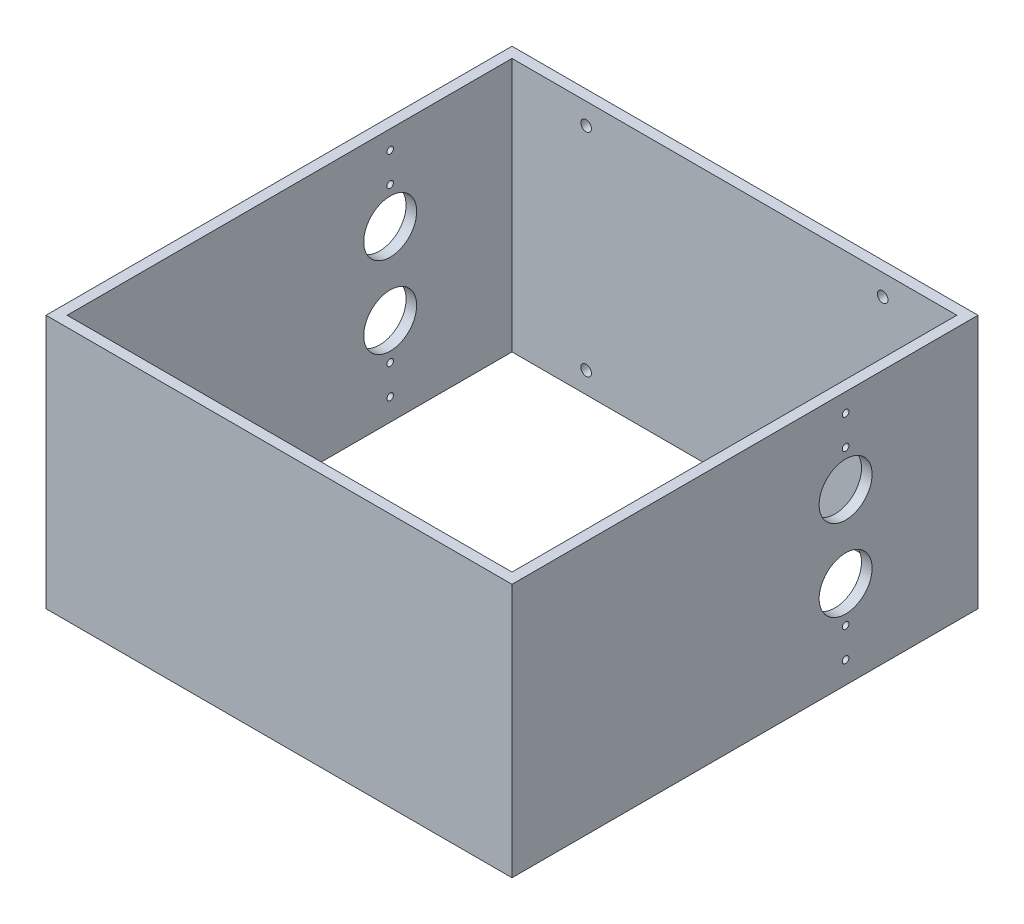
ISO-10303-21;
HEADER;
FILE_DESCRIPTION(('STEP AP214'),'2;1');
FILE_NAME('part.step','',(''),(''),'','','');
FILE_SCHEMA(('AUTOMOTIVE_DESIGN { 1 0 10303 214 1 1 1 1 }'));
ENDSEC;
DATA;
#1=APPLICATION_CONTEXT('core data for automotive mechanical design processes');
#2=APPLICATION_PROTOCOL_DEFINITION('international standard','automotive_design',2000,#1);
#3=PRODUCT_CONTEXT('',#1,'mechanical');
#4=PRODUCT('Part','Part','',(#3));
#5=PRODUCT_RELATED_PRODUCT_CATEGORY('part','',(#4));
#6=PRODUCT_DEFINITION_FORMATION('','',#4);
#7=PRODUCT_DEFINITION_CONTEXT('part definition',#1,'design');
#8=PRODUCT_DEFINITION('design','',#6,#7);
#9=PRODUCT_DEFINITION_SHAPE('','',#8);
#10=(LENGTH_UNIT() NAMED_UNIT(*) SI_UNIT(.MILLI.,.METRE.));
#11=(NAMED_UNIT(*) PLANE_ANGLE_UNIT() SI_UNIT($,.RADIAN.));
#12=(NAMED_UNIT(*) SI_UNIT($,.STERADIAN.) SOLID_ANGLE_UNIT());
#13=UNCERTAINTY_MEASURE_WITH_UNIT(LENGTH_MEASURE(1.E-05),#10,'distance_accuracy_value','');
#14=(GEOMETRIC_REPRESENTATION_CONTEXT(3) GLOBAL_UNCERTAINTY_ASSIGNED_CONTEXT((#13)) GLOBAL_UNIT_ASSIGNED_CONTEXT((#10,
#11,#12)) REPRESENTATION_CONTEXT('',''));
#15=CARTESIAN_POINT('',(0.,0.,0.));
#16=DIRECTION('',(0.,0.,1.));
#17=DIRECTION('',(1.,0.,0.));
#18=AXIS2_PLACEMENT_3D('',#15,#16,#17);
#19=CARTESIAN_POINT('',(-88.9,-12.7,-279.4));
#20=DIRECTION('',(0.,0.,-1.));
#21=DIRECTION('',(-1.,0.,0.));
#22=AXIS2_PLACEMENT_3D('',#19,#20,#21);
#23=CYLINDRICAL_SURFACE('',#22,3.175);
#24=CARTESIAN_POINT('',(-88.9,-12.7,-273.05));
#25=DIRECTION('',(0.,0.,-1.));
#26=DIRECTION('',(-1.,0.,0.));
#27=AXIS2_PLACEMENT_3D('',#24,#25,#26);
#28=CIRCLE('',#27,3.175);
#29=CARTESIAN_POINT('',(-92.075,-12.7,-273.05));
#30=VERTEX_POINT('',#29);
#31=EDGE_CURVE('E20',#30,#30,#28,.F.);
#32=ORIENTED_EDGE('',*,*,#31,.T.);
#33=EDGE_LOOP('',(#32));
#34=FACE_BOUND('',#33,.T.);
#35=CARTESIAN_POINT('',(-88.9,-12.7,-279.4));
#36=DIRECTION('',(0.,0.,-1.));
#37=DIRECTION('',(-1.,0.,0.));
#38=AXIS2_PLACEMENT_3D('',#35,#36,#37);
#39=CIRCLE('',#38,3.175);
#40=CARTESIAN_POINT('',(-92.075,-12.7,-279.4));
#41=VERTEX_POINT('',#40);
#42=EDGE_CURVE('E116',#41,#41,#39,.F.);
#43=ORIENTED_EDGE('',*,*,#42,.F.);
#44=EDGE_LOOP('',(#43));
#45=FACE_BOUND('',#44,.T.);
#46=ADVANCED_FACE('F17',(#34,#45),#23,.F.);
#47=CARTESIAN_POINT('',(88.9,-12.7,-279.4));
#48=DIRECTION('',(0.,0.,-1.));
#49=DIRECTION('',(-1.,0.,0.));
#50=AXIS2_PLACEMENT_3D('',#47,#48,#49);
#51=CYLINDRICAL_SURFACE('',#50,3.175);
#52=CARTESIAN_POINT('',(88.9,-12.7,-273.05));
#53=DIRECTION('',(0.,0.,-1.));
#54=DIRECTION('',(-1.,0.,0.));
#55=AXIS2_PLACEMENT_3D('',#52,#53,#54);
#56=CIRCLE('',#55,3.175);
#57=CARTESIAN_POINT('',(85.725,-12.7,-273.05));
#58=VERTEX_POINT('',#57);
#59=EDGE_CURVE('E209',#58,#58,#56,.F.);
#60=ORIENTED_EDGE('',*,*,#59,.T.);
#61=EDGE_LOOP('',(#60));
#62=FACE_BOUND('',#61,.T.);
#63=CARTESIAN_POINT('',(88.9,-12.7,-279.4));
#64=DIRECTION('',(0.,0.,-1.));
#65=DIRECTION('',(-1.,0.,0.));
#66=AXIS2_PLACEMENT_3D('',#63,#64,#65);
#67=CIRCLE('',#66,3.175);
#68=CARTESIAN_POINT('',(85.725,-12.7,-279.4));
#69=VERTEX_POINT('',#68);
#70=EDGE_CURVE('E184',#69,#69,#67,.F.);
#71=ORIENTED_EDGE('',*,*,#70,.F.);
#72=EDGE_LOOP('',(#71));
#73=FACE_BOUND('',#72,.T.);
#74=ADVANCED_FACE('F355',(#62,#73),#51,.F.);
#75=CARTESIAN_POINT('',(88.9,-139.7,-279.4));
#76=DIRECTION('',(0.,0.,-1.));
#77=DIRECTION('',(-1.,0.,0.));
#78=AXIS2_PLACEMENT_3D('',#75,#76,#77);
#79=CYLINDRICAL_SURFACE('',#78,3.175);
#80=CARTESIAN_POINT('',(88.9,-139.7,-273.05));
#81=DIRECTION('',(0.,0.,-1.));
#82=DIRECTION('',(-1.,0.,0.));
#83=AXIS2_PLACEMENT_3D('',#80,#81,#82);
#84=CIRCLE('',#83,3.175);
#85=CARTESIAN_POINT('',(85.725,-139.7,-273.05));
#86=VERTEX_POINT('',#85);
#87=EDGE_CURVE('E207',#86,#86,#84,.F.);
#88=ORIENTED_EDGE('',*,*,#87,.T.);
#89=EDGE_LOOP('',(#88));
#90=FACE_BOUND('',#89,.T.);
#91=CARTESIAN_POINT('',(88.9,-139.7,-279.4));
#92=DIRECTION('',(0.,0.,-1.));
#93=DIRECTION('',(-1.,0.,0.));
#94=AXIS2_PLACEMENT_3D('',#91,#92,#93);
#95=CIRCLE('',#94,3.175);
#96=CARTESIAN_POINT('',(85.725,-139.7,-279.4));
#97=VERTEX_POINT('',#96);
#98=EDGE_CURVE('E181',#97,#97,#95,.F.);
#99=ORIENTED_EDGE('',*,*,#98,.F.);
#100=EDGE_LOOP('',(#99));
#101=FACE_BOUND('',#100,.T.);
#102=ADVANCED_FACE('F352',(#90,#101),#79,.F.);
#103=CARTESIAN_POINT('',(-88.9,-139.7,-279.4));
#104=DIRECTION('',(0.,0.,-1.));
#105=DIRECTION('',(-1.,0.,0.));
#106=AXIS2_PLACEMENT_3D('',#103,#104,#105);
#107=CYLINDRICAL_SURFACE('',#106,3.175);
#108=CARTESIAN_POINT('',(-88.9,-139.7,-273.05));
#109=DIRECTION('',(0.,0.,-1.));
#110=DIRECTION('',(-1.,0.,0.));
#111=AXIS2_PLACEMENT_3D('',#108,#109,#110);
#112=CIRCLE('',#111,3.175);
#113=CARTESIAN_POINT('',(-92.075,-139.7,-273.05));
#114=VERTEX_POINT('',#113);
#115=EDGE_CURVE('E121',#114,#114,#112,.F.);
#116=ORIENTED_EDGE('',*,*,#115,.T.);
#117=EDGE_LOOP('',(#116));
#118=FACE_BOUND('',#117,.T.);
#119=CARTESIAN_POINT('',(-88.9,-139.7,-279.4));
#120=DIRECTION('',(0.,0.,-1.));
#121=DIRECTION('',(-1.,0.,0.));
#122=AXIS2_PLACEMENT_3D('',#119,#120,#121);
#123=CIRCLE('',#122,3.175);
#124=CARTESIAN_POINT('',(-92.075,-139.7,-279.4));
#125=VERTEX_POINT('',#124);
#126=EDGE_CURVE('E178',#125,#125,#123,.F.);
#127=ORIENTED_EDGE('',*,*,#126,.F.);
#128=EDGE_LOOP('',(#127));
#129=FACE_BOUND('',#128,.T.);
#130=ADVANCED_FACE('F348',(#118,#129),#107,.F.);
#131=CARTESIAN_POINT('',(-139.7,-50.8,-200.025));
#132=DIRECTION('',(1.,0.,0.));
#133=DIRECTION('',(0.,0.,-1.));
#134=AXIS2_PLACEMENT_3D('',#131,#132,#133);
#135=CYLINDRICAL_SURFACE('',#134,15.875);
#136=CARTESIAN_POINT('',(133.35,-50.8,-200.025));
#137=DIRECTION('',(1.,0.,0.));
#138=DIRECTION('',(0.,0.,-1.));
#139=AXIS2_PLACEMENT_3D('',#136,#137,#138);
#140=CIRCLE('',#139,15.875);
#141=CARTESIAN_POINT('',(133.35,-50.8,-215.9));
#142=VERTEX_POINT('',#141);
#143=EDGE_CURVE('E120',#142,#142,#140,.F.);
#144=ORIENTED_EDGE('',*,*,#143,.T.);
#145=EDGE_LOOP('',(#144));
#146=FACE_BOUND('',#145,.T.);
#147=CARTESIAN_POINT('',(139.7,-50.8,-200.025));
#148=DIRECTION('',(1.,0.,0.));
#149=DIRECTION('',(0.,0.,-1.));
#150=AXIS2_PLACEMENT_3D('',#147,#148,#149);
#151=CIRCLE('',#150,15.875);
#152=CARTESIAN_POINT('',(139.7,-50.8,-215.9));
#153=VERTEX_POINT('',#152);
#154=EDGE_CURVE('E157',#153,#153,#151,.F.);
#155=ORIENTED_EDGE('',*,*,#154,.F.);
#156=EDGE_LOOP('',(#155));
#157=FACE_BOUND('',#156,.T.);
#158=ADVANCED_FACE('F344',(#146,#157),#135,.F.);
#159=CARTESIAN_POINT('',(-139.7,-99.568,-200.025));
#160=DIRECTION('',(1.,0.,0.));
#161=DIRECTION('',(0.,0.,-1.));
#162=AXIS2_PLACEMENT_3D('',#159,#160,#161);
#163=CYLINDRICAL_SURFACE('',#162,15.875);
#164=CARTESIAN_POINT('',(133.35,-99.568,-200.025));
#165=DIRECTION('',(1.,0.,0.));
#166=DIRECTION('',(0.,0.,-1.));
#167=AXIS2_PLACEMENT_3D('',#164,#165,#166);
#168=CIRCLE('',#167,15.875);
#169=CARTESIAN_POINT('',(133.35,-99.568,-215.9));
#170=VERTEX_POINT('',#169);
#171=EDGE_CURVE('E200',#170,#170,#168,.F.);
#172=ORIENTED_EDGE('',*,*,#171,.T.);
#173=EDGE_LOOP('',(#172));
#174=FACE_BOUND('',#173,.T.);
#175=CARTESIAN_POINT('',(139.7,-99.568,-200.025));
#176=DIRECTION('',(1.,0.,0.));
#177=DIRECTION('',(0.,0.,-1.));
#178=AXIS2_PLACEMENT_3D('',#175,#176,#177);
#179=CIRCLE('',#178,15.875);
#180=CARTESIAN_POINT('',(139.7,-99.568,-215.9));
#181=VERTEX_POINT('',#180);
#182=EDGE_CURVE('E154',#181,#181,#179,.F.);
#183=ORIENTED_EDGE('',*,*,#182,.F.);
#184=EDGE_LOOP('',(#183));
#185=FACE_BOUND('',#184,.T.);
#186=ADVANCED_FACE('F340',(#174,#185),#163,.F.);
#187=CARTESIAN_POINT('',(-139.7,-139.192,-200.025));
#188=DIRECTION('',(-1.,0.,0.));
#189=DIRECTION('',(0.,0.,1.));
#190=AXIS2_PLACEMENT_3D('',#187,#188,#189);
#191=CYLINDRICAL_SURFACE('',#190,1.9812);
#192=CARTESIAN_POINT('',(133.35,-139.192,-200.025));
#193=DIRECTION('',(-1.,0.,0.));
#194=DIRECTION('',(0.,0.,1.));
#195=AXIS2_PLACEMENT_3D('',#192,#193,#194);
#196=CIRCLE('',#195,1.9812);
#197=CARTESIAN_POINT('',(133.35,-139.192,-198.0438));
#198=VERTEX_POINT('',#197);
#199=EDGE_CURVE('E197',#198,#198,#196,.T.);
#200=ORIENTED_EDGE('',*,*,#199,.T.);
#201=EDGE_LOOP('',(#200));
#202=FACE_BOUND('',#201,.T.);
#203=CARTESIAN_POINT('',(139.7,-139.192,-200.025));
#204=DIRECTION('',(-1.,0.,0.));
#205=DIRECTION('',(0.,0.,1.));
#206=AXIS2_PLACEMENT_3D('',#203,#204,#205);
#207=CIRCLE('',#206,1.9812);
#208=CARTESIAN_POINT('',(139.7,-139.192,-198.0438));
#209=VERTEX_POINT('',#208);
#210=EDGE_CURVE('E151',#209,#209,#207,.T.);
#211=ORIENTED_EDGE('',*,*,#210,.F.);
#212=EDGE_LOOP('',(#211));
#213=FACE_BOUND('',#212,.T.);
#214=ADVANCED_FACE('F336',(#202,#213),#191,.F.);
#215=CARTESIAN_POINT('',(-139.7,-121.412,-200.025));
#216=DIRECTION('',(-1.,0.,0.));
#217=DIRECTION('',(0.,0.,1.));
#218=AXIS2_PLACEMENT_3D('',#215,#216,#217);
#219=CYLINDRICAL_SURFACE('',#218,1.9812);
#220=CARTESIAN_POINT('',(133.35,-121.412,-200.025));
#221=DIRECTION('',(-1.,0.,0.));
#222=DIRECTION('',(0.,0.,1.));
#223=AXIS2_PLACEMENT_3D('',#220,#221,#222);
#224=CIRCLE('',#223,1.9812);
#225=CARTESIAN_POINT('',(133.35,-121.412,-198.0438));
#226=VERTEX_POINT('',#225);
#227=EDGE_CURVE('E194',#226,#226,#224,.T.);
#228=ORIENTED_EDGE('',*,*,#227,.T.);
#229=EDGE_LOOP('',(#228));
#230=FACE_BOUND('',#229,.T.);
#231=CARTESIAN_POINT('',(139.7,-121.412,-200.025));
#232=DIRECTION('',(-1.,0.,0.));
#233=DIRECTION('',(0.,0.,1.));
#234=AXIS2_PLACEMENT_3D('',#231,#232,#233);
#235=CIRCLE('',#234,1.9812);
#236=CARTESIAN_POINT('',(139.7,-121.412,-198.0438));
#237=VERTEX_POINT('',#236);
#238=EDGE_CURVE('E148',#237,#237,#235,.T.);
#239=ORIENTED_EDGE('',*,*,#238,.F.);
#240=EDGE_LOOP('',(#239));
#241=FACE_BOUND('',#240,.T.);
#242=ADVANCED_FACE('F332',(#230,#241),#219,.F.);
#243=CARTESIAN_POINT('',(-139.7,-28.956,-200.025));
#244=DIRECTION('',(-1.,0.,0.));
#245=DIRECTION('',(0.,0.,1.));
#246=AXIS2_PLACEMENT_3D('',#243,#244,#245);
#247=CYLINDRICAL_SURFACE('',#246,1.9812);
#248=CARTESIAN_POINT('',(133.35,-28.956,-200.025));
#249=DIRECTION('',(-1.,0.,0.));
#250=DIRECTION('',(0.,0.,1.));
#251=AXIS2_PLACEMENT_3D('',#248,#249,#250);
#252=CIRCLE('',#251,1.9812);
#253=CARTESIAN_POINT('',(133.35,-28.956,-198.0438));
#254=VERTEX_POINT('',#253);
#255=EDGE_CURVE('E191',#254,#254,#252,.T.);
#256=ORIENTED_EDGE('',*,*,#255,.T.);
#257=EDGE_LOOP('',(#256));
#258=FACE_BOUND('',#257,.T.);
#259=CARTESIAN_POINT('',(139.7,-28.956,-200.025));
#260=DIRECTION('',(-1.,0.,0.));
#261=DIRECTION('',(0.,0.,1.));
#262=AXIS2_PLACEMENT_3D('',#259,#260,#261);
#263=CIRCLE('',#262,1.9812);
#264=CARTESIAN_POINT('',(139.7,-28.956,-198.0438));
#265=VERTEX_POINT('',#264);
#266=EDGE_CURVE('E145',#265,#265,#263,.T.);
#267=ORIENTED_EDGE('',*,*,#266,.F.);
#268=EDGE_LOOP('',(#267));
#269=FACE_BOUND('',#268,.T.);
#270=ADVANCED_FACE('F328',(#258,#269),#247,.F.);
#271=CARTESIAN_POINT('',(-139.7,-11.176,-200.025));
#272=DIRECTION('',(-1.,0.,0.));
#273=DIRECTION('',(0.,0.,1.));
#274=AXIS2_PLACEMENT_3D('',#271,#272,#273);
#275=CYLINDRICAL_SURFACE('',#274,1.9812);
#276=CARTESIAN_POINT('',(133.35,-11.176,-200.025));
#277=DIRECTION('',(-1.,0.,0.));
#278=DIRECTION('',(0.,0.,1.));
#279=AXIS2_PLACEMENT_3D('',#276,#277,#278);
#280=CIRCLE('',#279,1.9812);
#281=CARTESIAN_POINT('',(133.35,-11.176,-198.0438));
#282=VERTEX_POINT('',#281);
#283=EDGE_CURVE('E92',#282,#282,#280,.T.);
#284=ORIENTED_EDGE('',*,*,#283,.T.);
#285=EDGE_LOOP('',(#284));
#286=FACE_BOUND('',#285,.T.);
#287=CARTESIAN_POINT('',(139.7,-11.176,-200.025));
#288=DIRECTION('',(-1.,0.,0.));
#289=DIRECTION('',(0.,0.,1.));
#290=AXIS2_PLACEMENT_3D('',#287,#288,#289);
#291=CIRCLE('',#290,1.9812);
#292=CARTESIAN_POINT('',(139.7,-11.176,-198.0438));
#293=VERTEX_POINT('',#292);
#294=EDGE_CURVE('E141',#293,#293,#291,.T.);
#295=ORIENTED_EDGE('',*,*,#294,.F.);
#296=EDGE_LOOP('',(#295));
#297=FACE_BOUND('',#296,.T.);
#298=ADVANCED_FACE('F221',(#286,#297),#275,.F.);
#299=CARTESIAN_POINT('',(-133.35,-152.4,-273.05));
#300=DIRECTION('',(0.,0.,-1.));
#301=DIRECTION('',(-1.,0.,0.));
#302=AXIS2_PLACEMENT_3D('',#299,#300,#301);
#303=PLANE('',#302);
#304=ORIENTED_EDGE('',*,*,#115,.F.);
#305=EDGE_LOOP('',(#304));
#306=FACE_BOUND('',#305,.T.);
#307=ORIENTED_EDGE('',*,*,#87,.F.);
#308=EDGE_LOOP('',(#307));
#309=FACE_BOUND('',#308,.T.);
#310=ORIENTED_EDGE('',*,*,#59,.F.);
#311=EDGE_LOOP('',(#310));
#312=FACE_BOUND('',#311,.T.);
#313=ORIENTED_EDGE('',*,*,#31,.F.);
#314=EDGE_LOOP('',(#313));
#315=FACE_BOUND('',#314,.T.);
#316=DIRECTION('',(1.,0.,0.));
#317=VECTOR('',#316,1.);
#318=CARTESIAN_POINT('',(-139.7,0.,-273.05));
#319=LINE('',#318,#317);
#320=CARTESIAN_POINT('',(-133.35,0.,-273.05));
#321=VERTEX_POINT('',#320);
#322=CARTESIAN_POINT('',(133.35,0.,-273.05));
#323=VERTEX_POINT('',#322);
#324=EDGE_CURVE('E225',#321,#323,#319,.T.);
#325=ORIENTED_EDGE('',*,*,#324,.F.);
#326=DIRECTION('',(0.,1.,0.));
#327=VECTOR('',#326,1.);
#328=CARTESIAN_POINT('',(-133.35,0.,-273.05));
#329=LINE('',#328,#327);
#330=CARTESIAN_POINT('',(-133.35,-152.4,-273.05));
#331=VERTEX_POINT('',#330);
#332=EDGE_CURVE('E91',#331,#321,#329,.T.);
#333=ORIENTED_EDGE('',*,*,#332,.F.);
#334=DIRECTION('',(1.,0.,0.));
#335=VECTOR('',#334,1.);
#336=CARTESIAN_POINT('',(-139.7,-152.4,-273.05));
#337=LINE('',#336,#335);
#338=CARTESIAN_POINT('',(133.35,-152.4,-273.05));
#339=VERTEX_POINT('',#338);
#340=EDGE_CURVE('E101',#339,#331,#337,.F.);
#341=ORIENTED_EDGE('',*,*,#340,.F.);
#342=DIRECTION('',(0.,1.,0.));
#343=VECTOR('',#342,1.);
#344=CARTESIAN_POINT('',(133.35,0.,-273.05));
#345=LINE('',#344,#343);
#346=EDGE_CURVE('E97',#339,#323,#345,.T.);
#347=ORIENTED_EDGE('',*,*,#346,.T.);
#348=EDGE_LOOP('',(#325,#333,#341,#347));
#349=FACE_BOUND('',#348,.T.);
#350=ADVANCED_FACE('F218',(#306,#309,#312,#315,#349),#303,.F.);
#351=CARTESIAN_POINT('',(133.35,0.,0.));
#352=DIRECTION('',(1.,0.,0.));
#353=DIRECTION('',(0.,0.,-1.));
#354=AXIS2_PLACEMENT_3D('',#351,#352,#353);
#355=PLANE('',#354);
#356=ORIENTED_EDGE('',*,*,#283,.F.);
#357=EDGE_LOOP('',(#356));
#358=FACE_BOUND('',#357,.T.);
#359=ORIENTED_EDGE('',*,*,#255,.F.);
#360=EDGE_LOOP('',(#359));
#361=FACE_BOUND('',#360,.T.);
#362=ORIENTED_EDGE('',*,*,#227,.F.);
#363=EDGE_LOOP('',(#362));
#364=FACE_BOUND('',#363,.T.);
#365=ORIENTED_EDGE('',*,*,#199,.F.);
#366=EDGE_LOOP('',(#365));
#367=FACE_BOUND('',#366,.T.);
#368=ORIENTED_EDGE('',*,*,#171,.F.);
#369=EDGE_LOOP('',(#368));
#370=FACE_BOUND('',#369,.T.);
#371=ORIENTED_EDGE('',*,*,#143,.F.);
#372=EDGE_LOOP('',(#371));
#373=FACE_BOUND('',#372,.T.);
#374=DIRECTION('',(0.,0.,1.));
#375=VECTOR('',#374,1.);
#376=CARTESIAN_POINT('',(133.35,0.,-279.4));
#377=LINE('',#376,#375);
#378=CARTESIAN_POINT('',(133.35,0.,-6.35));
#379=VERTEX_POINT('',#378);
#380=EDGE_CURVE('E228',#323,#379,#377,.T.);
#381=ORIENTED_EDGE('',*,*,#380,.F.);
#382=ORIENTED_EDGE('',*,*,#346,.F.);
#383=DIRECTION('',(0.,0.,-1.));
#384=VECTOR('',#383,1.);
#385=CARTESIAN_POINT('',(133.35,-152.4,0.));
#386=LINE('',#385,#384);
#387=CARTESIAN_POINT('',(133.35,-152.4,-6.35));
#388=VERTEX_POINT('',#387);
#389=EDGE_CURVE('E95',#388,#339,#386,.T.);
#390=ORIENTED_EDGE('',*,*,#389,.F.);
#391=DIRECTION('',(0.,1.,0.));
#392=VECTOR('',#391,1.);
#393=CARTESIAN_POINT('',(133.35,0.,-6.35));
#394=LINE('',#393,#392);
#395=EDGE_CURVE('E83',#388,#379,#394,.T.);
#396=ORIENTED_EDGE('',*,*,#395,.T.);
#397=EDGE_LOOP('',(#381,#382,#390,#396));
#398=FACE_BOUND('',#397,.T.);
#399=ADVANCED_FACE('F96',(#358,#361,#364,#367,#370,#373,#398),#355,.F.);
#400=CARTESIAN_POINT('',(-133.35,0.,-6.35));
#401=DIRECTION('',(0.,0.,1.));
#402=DIRECTION('',(1.,0.,0.));
#403=AXIS2_PLACEMENT_3D('',#400,#401,#402);
#404=PLANE('',#403);
#405=DIRECTION('',(1.,0.,0.));
#406=VECTOR('',#405,1.);
#407=CARTESIAN_POINT('',(-139.7,0.,-6.35000000000002));
#408=LINE('',#407,#406);
#409=CARTESIAN_POINT('',(-133.35,0.,-6.35));
#410=VERTEX_POINT('',#409);
#411=EDGE_CURVE('E87',#379,#410,#408,.F.);
#412=ORIENTED_EDGE('',*,*,#411,.F.);
#413=ORIENTED_EDGE('',*,*,#395,.F.);
#414=DIRECTION('',(1.,0.,0.));
#415=VECTOR('',#414,1.);
#416=CARTESIAN_POINT('',(-139.7,-152.4,-6.35));
#417=LINE('',#416,#415);
#418=CARTESIAN_POINT('',(-133.35,-152.4,-6.35));
#419=VERTEX_POINT('',#418);
#420=EDGE_CURVE('E80',#419,#388,#417,.T.);
#421=ORIENTED_EDGE('',*,*,#420,.F.);
#422=DIRECTION('',(0.,1.,0.));
#423=VECTOR('',#422,1.);
#424=CARTESIAN_POINT('',(-133.35,0.,-6.35));
#425=LINE('',#424,#423);
#426=EDGE_CURVE('E114',#410,#419,#425,.F.);
#427=ORIENTED_EDGE('',*,*,#426,.F.);
#428=EDGE_LOOP('',(#412,#413,#421,#427));
#429=FACE_BOUND('',#428,.T.);
#430=ADVANCED_FACE('F85',(#429),#404,.F.);
#431=CARTESIAN_POINT('',(-133.35,0.,0.));
#432=DIRECTION('',(1.,0.,0.));
#433=DIRECTION('',(0.,0.,-1.));
#434=AXIS2_PLACEMENT_3D('',#431,#432,#433);
#435=PLANE('',#434);
#436=CARTESIAN_POINT('',(-133.35,-11.176,-200.025));
#437=DIRECTION('',(-1.,0.,0.));
#438=DIRECTION('',(0.,0.,1.));
#439=AXIS2_PLACEMENT_3D('',#436,#437,#438);
#440=CIRCLE('',#439,1.9812);
#441=CARTESIAN_POINT('',(-133.35,-11.176,-198.0438));
#442=VERTEX_POINT('',#441);
#443=EDGE_CURVE('E110',#442,#442,#440,.T.);
#444=ORIENTED_EDGE('',*,*,#443,.T.);
#445=EDGE_LOOP('',(#444));
#446=FACE_BOUND('',#445,.T.);
#447=CARTESIAN_POINT('',(-133.35,-28.956,-200.025));
#448=DIRECTION('',(-1.,0.,0.));
#449=DIRECTION('',(0.,0.,1.));
#450=AXIS2_PLACEMENT_3D('',#447,#448,#449);
#451=CIRCLE('',#450,1.9812);
#452=CARTESIAN_POINT('',(-133.35,-28.956,-198.0438));
#453=VERTEX_POINT('',#452);
#454=EDGE_CURVE('E163',#453,#453,#451,.T.);
#455=ORIENTED_EDGE('',*,*,#454,.T.);
#456=EDGE_LOOP('',(#455));
#457=FACE_BOUND('',#456,.T.);
#458=CARTESIAN_POINT('',(-133.35,-121.412,-200.025));
#459=DIRECTION('',(-1.,0.,0.));
#460=DIRECTION('',(0.,0.,1.));
#461=AXIS2_PLACEMENT_3D('',#458,#459,#460);
#462=CIRCLE('',#461,1.9812);
#463=CARTESIAN_POINT('',(-133.35,-121.412,-198.0438));
#464=VERTEX_POINT('',#463);
#465=EDGE_CURVE('E166',#464,#464,#462,.T.);
#466=ORIENTED_EDGE('',*,*,#465,.T.);
#467=EDGE_LOOP('',(#466));
#468=FACE_BOUND('',#467,.T.);
#469=CARTESIAN_POINT('',(-133.35,-139.192,-200.025));
#470=DIRECTION('',(-1.,0.,0.));
#471=DIRECTION('',(0.,0.,1.));
#472=AXIS2_PLACEMENT_3D('',#469,#470,#471);
#473=CIRCLE('',#472,1.9812);
#474=CARTESIAN_POINT('',(-133.35,-139.192,-198.0438));
#475=VERTEX_POINT('',#474);
#476=EDGE_CURVE('E169',#475,#475,#473,.T.);
#477=ORIENTED_EDGE('',*,*,#476,.T.);
#478=EDGE_LOOP('',(#477));
#479=FACE_BOUND('',#478,.T.);
#480=CARTESIAN_POINT('',(-133.35,-99.568,-200.025));
#481=DIRECTION('',(1.,0.,0.));
#482=DIRECTION('',(0.,0.,-1.));
#483=AXIS2_PLACEMENT_3D('',#480,#481,#482);
#484=CIRCLE('',#483,15.875);
#485=CARTESIAN_POINT('',(-133.35,-99.568,-215.9));
#486=VERTEX_POINT('',#485);
#487=EDGE_CURVE('E172',#486,#486,#484,.F.);
#488=ORIENTED_EDGE('',*,*,#487,.T.);
#489=EDGE_LOOP('',(#488));
#490=FACE_BOUND('',#489,.T.);
#491=CARTESIAN_POINT('',(-133.35,-50.8,-200.025));
#492=DIRECTION('',(1.,0.,0.));
#493=DIRECTION('',(0.,0.,-1.));
#494=AXIS2_PLACEMENT_3D('',#491,#492,#493);
#495=CIRCLE('',#494,15.875);
#496=CARTESIAN_POINT('',(-133.35,-50.8,-215.9));
#497=VERTEX_POINT('',#496);
#498=EDGE_CURVE('E175',#497,#497,#495,.F.);
#499=ORIENTED_EDGE('',*,*,#498,.T.);
#500=EDGE_LOOP('',(#499));
#501=FACE_BOUND('',#500,.T.);
#502=ORIENTED_EDGE('',*,*,#426,.T.);
#503=DIRECTION('',(0.,0.,-1.));
#504=VECTOR('',#503,1.);
#505=CARTESIAN_POINT('',(-133.35,-152.4,0.));
#506=LINE('',#505,#504);
#507=EDGE_CURVE('E107',#331,#419,#506,.F.);
#508=ORIENTED_EDGE('',*,*,#507,.F.);
#509=ORIENTED_EDGE('',*,*,#332,.T.);
#510=DIRECTION('',(0.,0.,1.));
#511=VECTOR('',#510,1.);
#512=CARTESIAN_POINT('',(-133.35,0.,-279.4));
#513=LINE('',#512,#511);
#514=EDGE_CURVE('E234',#410,#321,#513,.F.);
#515=ORIENTED_EDGE('',*,*,#514,.F.);
#516=EDGE_LOOP('',(#502,#508,#509,#515));
#517=FACE_BOUND('',#516,.T.);
#518=ADVANCED_FACE('F233',(#446,#457,#468,#479,#490,#501,#517),#435,.T.);
#519=CARTESIAN_POINT('',(-139.7,-152.4,-279.4));
#520=DIRECTION('',(0.,0.,-1.));
#521=DIRECTION('',(-1.,0.,0.));
#522=AXIS2_PLACEMENT_3D('',#519,#520,#521);
#523=PLANE('',#522);
#524=ORIENTED_EDGE('',*,*,#126,.T.);
#525=EDGE_LOOP('',(#524));
#526=FACE_BOUND('',#525,.T.);
#527=ORIENTED_EDGE('',*,*,#98,.T.);
#528=EDGE_LOOP('',(#527));
#529=FACE_BOUND('',#528,.T.);
#530=ORIENTED_EDGE('',*,*,#70,.T.);
#531=EDGE_LOOP('',(#530));
#532=FACE_BOUND('',#531,.T.);
#533=ORIENTED_EDGE('',*,*,#42,.T.);
#534=EDGE_LOOP('',(#533));
#535=FACE_BOUND('',#534,.T.);
#536=DIRECTION('',(1.,0.,0.));
#537=VECTOR('',#536,1.);
#538=CARTESIAN_POINT('',(-139.7,-152.4,-279.4));
#539=LINE('',#538,#537);
#540=CARTESIAN_POINT('',(-139.7,-152.4,-279.4));
#541=VERTEX_POINT('',#540);
#542=CARTESIAN_POINT('',(139.7,-152.4,-279.4));
#543=VERTEX_POINT('',#542);
#544=EDGE_CURVE('E108',#541,#543,#539,.T.);
#545=ORIENTED_EDGE('',*,*,#544,.F.);
#546=DIRECTION('',(0.,1.,0.));
#547=VECTOR('',#546,1.);
#548=CARTESIAN_POINT('',(-139.7,0.,-279.4));
#549=LINE('',#548,#547);
#550=CARTESIAN_POINT('',(-139.7,0.,-279.4));
#551=VERTEX_POINT('',#550);
#552=EDGE_CURVE('E239',#541,#551,#549,.T.);
#553=ORIENTED_EDGE('',*,*,#552,.T.);
#554=DIRECTION('',(1.,0.,0.));
#555=VECTOR('',#554,1.);
#556=CARTESIAN_POINT('',(-139.7,0.,-279.4));
#557=LINE('',#556,#555);
#558=CARTESIAN_POINT('',(139.7,0.,-279.4));
#559=VERTEX_POINT('',#558);
#560=EDGE_CURVE('E229',#559,#551,#557,.F.);
#561=ORIENTED_EDGE('',*,*,#560,.F.);
#562=DIRECTION('',(0.,1.,0.));
#563=VECTOR('',#562,1.);
#564=CARTESIAN_POINT('',(139.7,0.,-279.4));
#565=LINE('',#564,#563);
#566=EDGE_CURVE('E160',#543,#559,#565,.T.);
#567=ORIENTED_EDGE('',*,*,#566,.F.);
#568=EDGE_LOOP('',(#545,#553,#561,#567));
#569=FACE_BOUND('',#568,.T.);
#570=ADVANCED_FACE('F263',(#526,#529,#532,#535,#569),#523,.T.);
#571=CARTESIAN_POINT('',(-139.7,-50.8,-200.025));
#572=DIRECTION('',(1.,0.,0.));
#573=DIRECTION('',(0.,0.,-1.));
#574=AXIS2_PLACEMENT_3D('',#571,#572,#573);
#575=CYLINDRICAL_SURFACE('',#574,15.875);
#576=ORIENTED_EDGE('',*,*,#498,.F.);
#577=EDGE_LOOP('',(#576));
#578=FACE_BOUND('',#577,.T.);
#579=CARTESIAN_POINT('',(-139.7,-50.8,-200.025));
#580=DIRECTION('',(1.,0.,0.));
#581=DIRECTION('',(0.,0.,-1.));
#582=AXIS2_PLACEMENT_3D('',#579,#580,#581);
#583=CIRCLE('',#582,15.875);
#584=CARTESIAN_POINT('',(-139.7,-50.8,-215.9));
#585=VERTEX_POINT('',#584);
#586=EDGE_CURVE('E138',#585,#585,#583,.F.);
#587=ORIENTED_EDGE('',*,*,#586,.T.);
#588=EDGE_LOOP('',(#587));
#589=FACE_BOUND('',#588,.T.);
#590=ADVANCED_FACE('F310',(#578,#589),#575,.F.);
#591=CARTESIAN_POINT('',(-139.7,-99.568,-200.025));
#592=DIRECTION('',(1.,0.,0.));
#593=DIRECTION('',(0.,0.,-1.));
#594=AXIS2_PLACEMENT_3D('',#591,#592,#593);
#595=CYLINDRICAL_SURFACE('',#594,15.875);
#596=ORIENTED_EDGE('',*,*,#487,.F.);
#597=EDGE_LOOP('',(#596));
#598=FACE_BOUND('',#597,.T.);
#599=CARTESIAN_POINT('',(-139.7,-99.568,-200.025));
#600=DIRECTION('',(1.,0.,0.));
#601=DIRECTION('',(0.,0.,-1.));
#602=AXIS2_PLACEMENT_3D('',#599,#600,#601);
#603=CIRCLE('',#602,15.875);
#604=CARTESIAN_POINT('',(-139.7,-99.568,-215.9));
#605=VERTEX_POINT('',#604);
#606=EDGE_CURVE('E135',#605,#605,#603,.F.);
#607=ORIENTED_EDGE('',*,*,#606,.T.);
#608=EDGE_LOOP('',(#607));
#609=FACE_BOUND('',#608,.T.);
#610=ADVANCED_FACE('F306',(#598,#609),#595,.F.);
#611=CARTESIAN_POINT('',(-139.7,-139.192,-200.025));
#612=DIRECTION('',(-1.,0.,0.));
#613=DIRECTION('',(0.,0.,1.));
#614=AXIS2_PLACEMENT_3D('',#611,#612,#613);
#615=CYLINDRICAL_SURFACE('',#614,1.9812);
#616=ORIENTED_EDGE('',*,*,#476,.F.);
#617=EDGE_LOOP('',(#616));
#618=FACE_BOUND('',#617,.T.);
#619=CARTESIAN_POINT('',(-139.7,-139.192,-200.025));
#620=DIRECTION('',(-1.,0.,0.));
#621=DIRECTION('',(0.,0.,1.));
#622=AXIS2_PLACEMENT_3D('',#619,#620,#621);
#623=CIRCLE('',#622,1.9812);
#624=CARTESIAN_POINT('',(-139.7,-139.192,-198.0438));
#625=VERTEX_POINT('',#624);
#626=EDGE_CURVE('E132',#625,#625,#623,.T.);
#627=ORIENTED_EDGE('',*,*,#626,.T.);
#628=EDGE_LOOP('',(#627));
#629=FACE_BOUND('',#628,.T.);
#630=ADVANCED_FACE('F302',(#618,#629),#615,.F.);
#631=CARTESIAN_POINT('',(-139.7,-121.412,-200.025));
#632=DIRECTION('',(-1.,0.,0.));
#633=DIRECTION('',(0.,0.,1.));
#634=AXIS2_PLACEMENT_3D('',#631,#632,#633);
#635=CYLINDRICAL_SURFACE('',#634,1.9812);
#636=ORIENTED_EDGE('',*,*,#465,.F.);
#637=EDGE_LOOP('',(#636));
#638=FACE_BOUND('',#637,.T.);
#639=CARTESIAN_POINT('',(-139.7,-121.412,-200.025));
#640=DIRECTION('',(-1.,0.,0.));
#641=DIRECTION('',(0.,0.,1.));
#642=AXIS2_PLACEMENT_3D('',#639,#640,#641);
#643=CIRCLE('',#642,1.9812);
#644=CARTESIAN_POINT('',(-139.7,-121.412,-198.0438));
#645=VERTEX_POINT('',#644);
#646=EDGE_CURVE('E129',#645,#645,#643,.T.);
#647=ORIENTED_EDGE('',*,*,#646,.T.);
#648=EDGE_LOOP('',(#647));
#649=FACE_BOUND('',#648,.T.);
#650=ADVANCED_FACE('F298',(#638,#649),#635,.F.);
#651=CARTESIAN_POINT('',(-139.7,-28.956,-200.025));
#652=DIRECTION('',(-1.,0.,0.));
#653=DIRECTION('',(0.,0.,1.));
#654=AXIS2_PLACEMENT_3D('',#651,#652,#653);
#655=CYLINDRICAL_SURFACE('',#654,1.9812);
#656=ORIENTED_EDGE('',*,*,#454,.F.);
#657=EDGE_LOOP('',(#656));
#658=FACE_BOUND('',#657,.T.);
#659=CARTESIAN_POINT('',(-139.7,-28.956,-200.025));
#660=DIRECTION('',(-1.,0.,0.));
#661=DIRECTION('',(0.,0.,1.));
#662=AXIS2_PLACEMENT_3D('',#659,#660,#661);
#663=CIRCLE('',#662,1.9812);
#664=CARTESIAN_POINT('',(-139.7,-28.956,-198.0438));
#665=VERTEX_POINT('',#664);
#666=EDGE_CURVE('E126',#665,#665,#663,.T.);
#667=ORIENTED_EDGE('',*,*,#666,.T.);
#668=EDGE_LOOP('',(#667));
#669=FACE_BOUND('',#668,.T.);
#670=ADVANCED_FACE('F294',(#658,#669),#655,.F.);
#671=CARTESIAN_POINT('',(-139.7,-11.176,-200.025));
#672=DIRECTION('',(-1.,0.,0.));
#673=DIRECTION('',(0.,0.,1.));
#674=AXIS2_PLACEMENT_3D('',#671,#672,#673);
#675=CYLINDRICAL_SURFACE('',#674,1.9812);
#676=ORIENTED_EDGE('',*,*,#443,.F.);
#677=EDGE_LOOP('',(#676));
#678=FACE_BOUND('',#677,.T.);
#679=CARTESIAN_POINT('',(-139.7,-11.176,-200.025));
#680=DIRECTION('',(-1.,0.,0.));
#681=DIRECTION('',(0.,0.,1.));
#682=AXIS2_PLACEMENT_3D('',#679,#680,#681);
#683=CIRCLE('',#682,1.9812);
#684=CARTESIAN_POINT('',(-139.7,-11.176,-198.0438));
#685=VERTEX_POINT('',#684);
#686=EDGE_CURVE('E122',#685,#685,#683,.T.);
#687=ORIENTED_EDGE('',*,*,#686,.T.);
#688=EDGE_LOOP('',(#687));
#689=FACE_BOUND('',#688,.T.);
#690=ADVANCED_FACE('F291',(#678,#689),#675,.F.);
#691=CARTESIAN_POINT('',(-139.7,-152.4,0.));
#692=DIRECTION('',(0.,-1.,0.));
#693=DIRECTION('',(0.,0.,-1.));
#694=AXIS2_PLACEMENT_3D('',#691,#692,#693);
#695=PLANE('',#694);
#696=ORIENTED_EDGE('',*,*,#340,.T.);
#697=ORIENTED_EDGE('',*,*,#507,.T.);
#698=ORIENTED_EDGE('',*,*,#420,.T.);
#699=ORIENTED_EDGE('',*,*,#389,.T.);
#700=EDGE_LOOP('',(#696,#697,#698,#699));
#701=FACE_BOUND('',#700,.T.);
#702=DIRECTION('',(1.,0.,0.));
#703=VECTOR('',#702,1.);
#704=CARTESIAN_POINT('',(-139.7,-152.4,0.));
#705=LINE('',#704,#703);
#706=CARTESIAN_POINT('',(-139.7,-152.4,0.));
#707=VERTEX_POINT('',#706);
#708=CARTESIAN_POINT('',(139.7,-152.4,0.));
#709=VERTEX_POINT('',#708);
#710=EDGE_CURVE('E125',#707,#709,#705,.T.);
#711=ORIENTED_EDGE('',*,*,#710,.F.);
#712=DIRECTION('',(0.,0.,-1.));
#713=VECTOR('',#712,1.);
#714=CARTESIAN_POINT('',(-139.7,-152.4,0.));
#715=LINE('',#714,#713);
#716=EDGE_CURVE('E236',#707,#541,#715,.T.);
#717=ORIENTED_EDGE('',*,*,#716,.T.);
#718=ORIENTED_EDGE('',*,*,#544,.T.);
#719=DIRECTION('',(0.,0.,-1.));
#720=VECTOR('',#719,1.);
#721=CARTESIAN_POINT('',(139.7,-152.4,0.));
#722=LINE('',#721,#720);
#723=EDGE_CURVE('E249',#709,#543,#722,.T.);
#724=ORIENTED_EDGE('',*,*,#723,.F.);
#725=EDGE_LOOP('',(#711,#717,#718,#724));
#726=FACE_BOUND('',#725,.T.);
#727=ADVANCED_FACE('F104',(#701,#726),#695,.T.);
#728=CARTESIAN_POINT('',(139.7,0.,0.));
#729=DIRECTION('',(1.,0.,0.));
#730=DIRECTION('',(0.,0.,-1.));
#731=AXIS2_PLACEMENT_3D('',#728,#729,#730);
#732=PLANE('',#731);
#733=ORIENTED_EDGE('',*,*,#294,.T.);
#734=EDGE_LOOP('',(#733));
#735=FACE_BOUND('',#734,.T.);
#736=ORIENTED_EDGE('',*,*,#266,.T.);
#737=EDGE_LOOP('',(#736));
#738=FACE_BOUND('',#737,.T.);
#739=ORIENTED_EDGE('',*,*,#238,.T.);
#740=EDGE_LOOP('',(#739));
#741=FACE_BOUND('',#740,.T.);
#742=ORIENTED_EDGE('',*,*,#210,.T.);
#743=EDGE_LOOP('',(#742));
#744=FACE_BOUND('',#743,.T.);
#745=ORIENTED_EDGE('',*,*,#182,.T.);
#746=EDGE_LOOP('',(#745));
#747=FACE_BOUND('',#746,.T.);
#748=ORIENTED_EDGE('',*,*,#154,.T.);
#749=EDGE_LOOP('',(#748));
#750=FACE_BOUND('',#749,.T.);
#751=DIRECTION('',(0.,0.,1.));
#752=VECTOR('',#751,1.);
#753=CARTESIAN_POINT('',(139.7,0.,-279.4));
#754=LINE('',#753,#752);
#755=CARTESIAN_POINT('',(139.7,0.,0.));
#756=VERTEX_POINT('',#755);
#757=EDGE_CURVE('E144',#756,#559,#754,.F.);
#758=ORIENTED_EDGE('',*,*,#757,.F.);
#759=DIRECTION('',(0.,1.,0.));
#760=VECTOR('',#759,1.);
#761=CARTESIAN_POINT('',(139.7,0.,0.));
#762=LINE('',#761,#760);
#763=EDGE_CURVE('E258',#709,#756,#762,.T.);
#764=ORIENTED_EDGE('',*,*,#763,.F.);
#765=ORIENTED_EDGE('',*,*,#723,.T.);
#766=ORIENTED_EDGE('',*,*,#566,.T.);
#767=EDGE_LOOP('',(#758,#764,#765,#766));
#768=FACE_BOUND('',#767,.T.);
#769=ADVANCED_FACE('F254',(#735,#738,#741,#744,#747,#750,#768),#732,.T.);
#770=CARTESIAN_POINT('',(-139.7,0.,-279.4));
#771=DIRECTION('',(0.,1.,0.));
#772=DIRECTION('',(0.,0.,1.));
#773=AXIS2_PLACEMENT_3D('',#770,#771,#772);
#774=PLANE('',#773);
#775=ORIENTED_EDGE('',*,*,#411,.T.);
#776=ORIENTED_EDGE('',*,*,#514,.T.);
#777=ORIENTED_EDGE('',*,*,#324,.T.);
#778=ORIENTED_EDGE('',*,*,#380,.T.);
#779=EDGE_LOOP('',(#775,#776,#777,#778));
#780=FACE_BOUND('',#779,.T.);
#781=ORIENTED_EDGE('',*,*,#560,.T.);
#782=DIRECTION('',(0.,0.,-1.));
#783=VECTOR('',#782,1.);
#784=CARTESIAN_POINT('',(-139.7,0.,0.));
#785=LINE('',#784,#783);
#786=CARTESIAN_POINT('',(-139.7,0.,0.));
#787=VERTEX_POINT('',#786);
#788=EDGE_CURVE('E35',#551,#787,#785,.F.);
#789=ORIENTED_EDGE('',*,*,#788,.T.);
#790=DIRECTION('',(1.,0.,0.));
#791=VECTOR('',#790,1.);
#792=CARTESIAN_POINT('',(-139.7,0.,0.));
#793=LINE('',#792,#791);
#794=EDGE_CURVE('E26',#756,#787,#793,.F.);
#795=ORIENTED_EDGE('',*,*,#794,.F.);
#796=ORIENTED_EDGE('',*,*,#757,.T.);
#797=EDGE_LOOP('',(#781,#789,#795,#796));
#798=FACE_BOUND('',#797,.T.);
#799=ADVANCED_FACE('F235',(#780,#798),#774,.T.);
#800=CARTESIAN_POINT('',(-139.7,0.,0.));
#801=DIRECTION('',(1.,0.,0.));
#802=DIRECTION('',(0.,0.,-1.));
#803=AXIS2_PLACEMENT_3D('',#800,#801,#802);
#804=PLANE('',#803);
#805=ORIENTED_EDGE('',*,*,#686,.F.);
#806=EDGE_LOOP('',(#805));
#807=FACE_BOUND('',#806,.T.);
#808=ORIENTED_EDGE('',*,*,#666,.F.);
#809=EDGE_LOOP('',(#808));
#810=FACE_BOUND('',#809,.T.);
#811=ORIENTED_EDGE('',*,*,#646,.F.);
#812=EDGE_LOOP('',(#811));
#813=FACE_BOUND('',#812,.T.);
#814=ORIENTED_EDGE('',*,*,#626,.F.);
#815=EDGE_LOOP('',(#814));
#816=FACE_BOUND('',#815,.T.);
#817=ORIENTED_EDGE('',*,*,#606,.F.);
#818=EDGE_LOOP('',(#817));
#819=FACE_BOUND('',#818,.T.);
#820=ORIENTED_EDGE('',*,*,#586,.F.);
#821=EDGE_LOOP('',(#820));
#822=FACE_BOUND('',#821,.T.);
#823=ORIENTED_EDGE('',*,*,#552,.F.);
#824=ORIENTED_EDGE('',*,*,#716,.F.);
#825=DIRECTION('',(0.,1.,0.));
#826=VECTOR('',#825,1.);
#827=CARTESIAN_POINT('',(-139.7,0.,0.));
#828=LINE('',#827,#826);
#829=EDGE_CURVE('E11',#787,#707,#828,.F.);
#830=ORIENTED_EDGE('',*,*,#829,.F.);
#831=ORIENTED_EDGE('',*,*,#788,.F.);
#832=EDGE_LOOP('',(#823,#824,#830,#831));
#833=FACE_BOUND('',#832,.T.);
#834=ADVANCED_FACE('F272',(#807,#810,#813,#816,#819,#822,#833),#804,.F.);
#835=CARTESIAN_POINT('',(-139.7,0.,0.));
#836=DIRECTION('',(0.,0.,1.));
#837=DIRECTION('',(1.,0.,0.));
#838=AXIS2_PLACEMENT_3D('',#835,#836,#837);
#839=PLANE('',#838);
#840=ORIENTED_EDGE('',*,*,#794,.T.);
#841=ORIENTED_EDGE('',*,*,#829,.T.);
#842=ORIENTED_EDGE('',*,*,#710,.T.);
#843=ORIENTED_EDGE('',*,*,#763,.T.);
#844=EDGE_LOOP('',(#840,#841,#842,#843));
#845=FACE_BOUND('',#844,.T.);
#846=ADVANCED_FACE('F267',(#845),#839,.T.);
#847=CLOSED_SHELL('',(#46,#74,#102,#130,#158,#186,#214,#242,#270,#298,#350,#399,#430,#518,#570,
#590,#610,#630,#650,#670,#690,#727,#769,#799,#834,#846));
#848=MANIFOLD_SOLID_BREP('B1',#847);
#849=ADVANCED_BREP_SHAPE_REPRESENTATION('',(#18,#848),#14);
#850=SHAPE_DEFINITION_REPRESENTATION(#9,#849);
ENDSEC;
END-ISO-10303-21;
